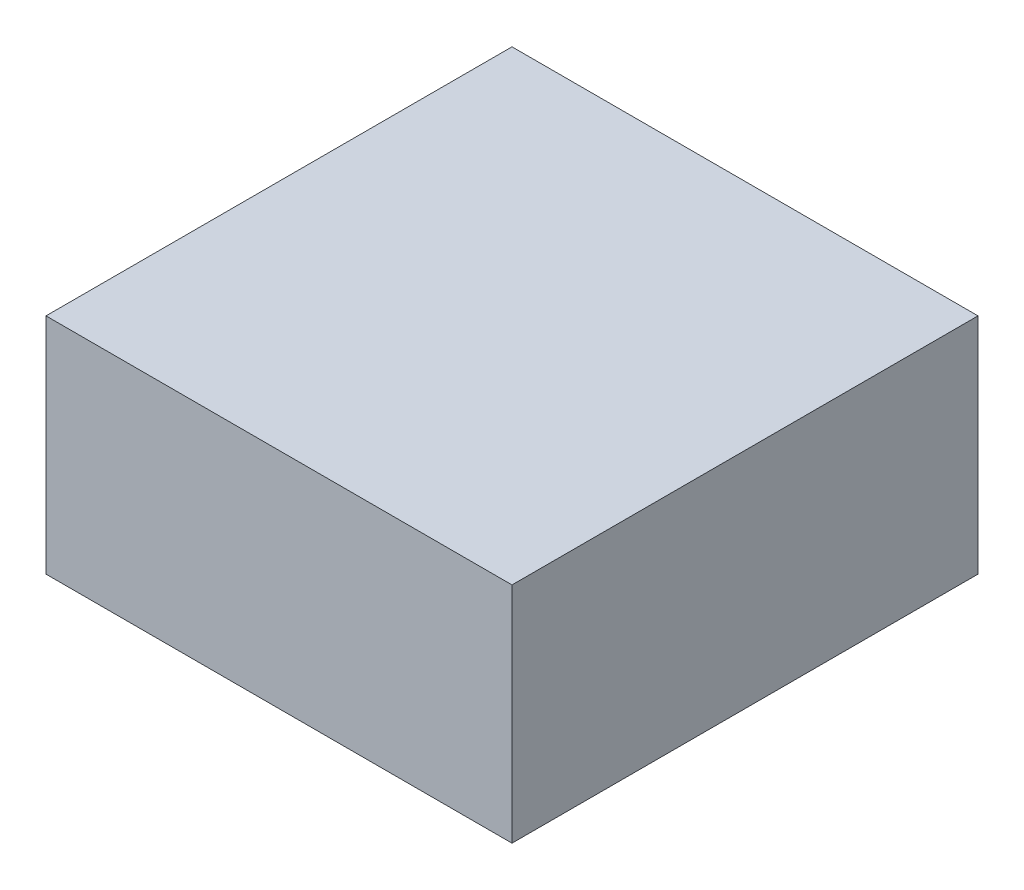
ISO-10303-21;
HEADER;
FILE_DESCRIPTION(('STEP AP214'),'2;1');
FILE_NAME('part.step','',(''),(''),'','','');
FILE_SCHEMA(('AUTOMOTIVE_DESIGN { 1 0 10303 214 1 1 1 1 }'));
ENDSEC;
DATA;
#1=APPLICATION_CONTEXT('core data for automotive mechanical design processes');
#2=APPLICATION_PROTOCOL_DEFINITION('international standard','automotive_design',2000,#1);
#3=PRODUCT_CONTEXT('',#1,'mechanical');
#4=PRODUCT('Part','Part','',(#3));
#5=PRODUCT_RELATED_PRODUCT_CATEGORY('part','',(#4));
#6=PRODUCT_DEFINITION_FORMATION('','',#4);
#7=PRODUCT_DEFINITION_CONTEXT('part definition',#1,'design');
#8=PRODUCT_DEFINITION('design','',#6,#7);
#9=PRODUCT_DEFINITION_SHAPE('','',#8);
#10=(LENGTH_UNIT() NAMED_UNIT(*) SI_UNIT(.MILLI.,.METRE.));
#11=(NAMED_UNIT(*) PLANE_ANGLE_UNIT() SI_UNIT($,.RADIAN.));
#12=(NAMED_UNIT(*) SI_UNIT($,.STERADIAN.) SOLID_ANGLE_UNIT());
#13=UNCERTAINTY_MEASURE_WITH_UNIT(LENGTH_MEASURE(1.E-05),#10,'distance_accuracy_value','');
#14=(GEOMETRIC_REPRESENTATION_CONTEXT(3) GLOBAL_UNCERTAINTY_ASSIGNED_CONTEXT((#13)) GLOBAL_UNIT_ASSIGNED_CONTEXT((#10,
#11,#12)) REPRESENTATION_CONTEXT('',''));
#15=CARTESIAN_POINT('',(0.,0.,0.));
#16=DIRECTION('',(0.,0.,1.));
#17=DIRECTION('',(1.,0.,0.));
#18=AXIS2_PLACEMENT_3D('',#15,#16,#17);
#19=CARTESIAN_POINT('',(-6.35,3.048,-6.35));
#20=DIRECTION('',(1.,0.,0.));
#21=DIRECTION('',(0.,0.,-1.));
#22=AXIS2_PLACEMENT_3D('',#19,#20,#21);
#23=PLANE('',#22);
#24=DIRECTION('',(0.,0.,1.));
#25=VECTOR('',#24,1.);
#26=CARTESIAN_POINT('',(-6.35,-3.048,-6.35));
#27=LINE('',#26,#25);
#28=CARTESIAN_POINT('',(-6.35,-3.048,-6.35));
#29=VERTEX_POINT('',#28);
#30=CARTESIAN_POINT('',(-6.35,-3.048,6.35));
#31=VERTEX_POINT('',#30);
#32=EDGE_CURVE('E96',#29,#31,#27,.T.);
#33=ORIENTED_EDGE('',*,*,#32,.T.);
#34=DIRECTION('',(0.,-1.,0.));
#35=VECTOR('',#34,1.);
#36=CARTESIAN_POINT('',(-6.35,3.048,6.35));
#37=LINE('',#36,#35);
#38=CARTESIAN_POINT('',(-6.35,3.048,6.35));
#39=VERTEX_POINT('',#38);
#40=EDGE_CURVE('E11',#39,#31,#37,.T.);
#41=ORIENTED_EDGE('',*,*,#40,.F.);
#42=DIRECTION('',(0.,0.,1.));
#43=VECTOR('',#42,1.);
#44=CARTESIAN_POINT('',(-6.35,3.048,-6.35));
#45=LINE('',#44,#43);
#46=CARTESIAN_POINT('',(-6.35,3.048,-6.35));
#47=VERTEX_POINT('',#46);
#48=EDGE_CURVE('E84',#47,#39,#45,.T.);
#49=ORIENTED_EDGE('',*,*,#48,.F.);
#50=DIRECTION('',(0.,-1.,0.));
#51=VECTOR('',#50,1.);
#52=CARTESIAN_POINT('',(-6.35,3.048,-6.35));
#53=LINE('',#52,#51);
#54=EDGE_CURVE('E92',#47,#29,#53,.T.);
#55=ORIENTED_EDGE('',*,*,#54,.T.);
#56=EDGE_LOOP('',(#33,#41,#49,#55));
#57=FACE_BOUND('',#56,.T.);
#58=ADVANCED_FACE('F33',(#57),#23,.F.);
#59=CARTESIAN_POINT('',(-6.35,3.048,6.35));
#60=DIRECTION('',(0.,0.,-1.));
#61=DIRECTION('',(-1.,0.,0.));
#62=AXIS2_PLACEMENT_3D('',#59,#60,#61);
#63=PLANE('',#62);
#64=DIRECTION('',(1.,0.,0.));
#65=VECTOR('',#64,1.);
#66=CARTESIAN_POINT('',(-6.35,-3.048,6.35));
#67=LINE('',#66,#65);
#68=CARTESIAN_POINT('',(6.35,-3.048,6.35));
#69=VERTEX_POINT('',#68);
#70=EDGE_CURVE('E88',#31,#69,#67,.T.);
#71=ORIENTED_EDGE('',*,*,#70,.T.);
#72=DIRECTION('',(0.,-1.,0.));
#73=VECTOR('',#72,1.);
#74=CARTESIAN_POINT('',(6.35,3.048,6.35));
#75=LINE('',#74,#73);
#76=CARTESIAN_POINT('',(6.35,3.048,6.35));
#77=VERTEX_POINT('',#76);
#78=EDGE_CURVE('E41',#77,#69,#75,.T.);
#79=ORIENTED_EDGE('',*,*,#78,.F.);
#80=DIRECTION('',(1.,0.,0.));
#81=VECTOR('',#80,1.);
#82=CARTESIAN_POINT('',(-6.35,3.048,6.35));
#83=LINE('',#82,#81);
#84=EDGE_CURVE('E79',#39,#77,#83,.T.);
#85=ORIENTED_EDGE('',*,*,#84,.F.);
#86=ORIENTED_EDGE('',*,*,#40,.T.);
#87=EDGE_LOOP('',(#71,#79,#85,#86));
#88=FACE_BOUND('',#87,.T.);
#89=ADVANCED_FACE('F87',(#88),#63,.F.);
#90=CARTESIAN_POINT('',(6.35,3.048,-6.35));
#91=DIRECTION('',(-1.,0.,0.));
#92=DIRECTION('',(0.,0.,1.));
#93=AXIS2_PLACEMENT_3D('',#90,#91,#92);
#94=PLANE('',#93);
#95=DIRECTION('',(0.,0.,-1.));
#96=VECTOR('',#95,1.);
#97=CARTESIAN_POINT('',(6.35,-3.048,-6.35));
#98=LINE('',#97,#96);
#99=CARTESIAN_POINT('',(6.35,-3.048,-6.35));
#100=VERTEX_POINT('',#99);
#101=EDGE_CURVE('E66',#69,#100,#98,.T.);
#102=ORIENTED_EDGE('',*,*,#101,.T.);
#103=DIRECTION('',(0.,-1.,0.));
#104=VECTOR('',#103,1.);
#105=CARTESIAN_POINT('',(6.35,3.048,-6.35));
#106=LINE('',#105,#104);
#107=CARTESIAN_POINT('',(6.35,3.048,-6.35));
#108=VERTEX_POINT('',#107);
#109=EDGE_CURVE('E89',#108,#100,#106,.T.);
#110=ORIENTED_EDGE('',*,*,#109,.F.);
#111=DIRECTION('',(0.,0.,-1.));
#112=VECTOR('',#111,1.);
#113=CARTESIAN_POINT('',(6.35,3.048,-6.35));
#114=LINE('',#113,#112);
#115=EDGE_CURVE('E82',#77,#108,#114,.T.);
#116=ORIENTED_EDGE('',*,*,#115,.F.);
#117=ORIENTED_EDGE('',*,*,#78,.T.);
#118=EDGE_LOOP('',(#102,#110,#116,#117));
#119=FACE_BOUND('',#118,.T.);
#120=ADVANCED_FACE('F90',(#119),#94,.F.);
#121=CARTESIAN_POINT('',(-6.35,3.048,-6.35));
#122=DIRECTION('',(0.,0.,1.));
#123=DIRECTION('',(1.,0.,0.));
#124=AXIS2_PLACEMENT_3D('',#121,#122,#123);
#125=PLANE('',#124);
#126=DIRECTION('',(-1.,0.,0.));
#127=VECTOR('',#126,1.);
#128=CARTESIAN_POINT('',(-6.35,-3.048,-6.35));
#129=LINE('',#128,#127);
#130=EDGE_CURVE('E72',#100,#29,#129,.T.);
#131=ORIENTED_EDGE('',*,*,#130,.T.);
#132=ORIENTED_EDGE('',*,*,#54,.F.);
#133=DIRECTION('',(-1.,0.,0.));
#134=VECTOR('',#133,1.);
#135=CARTESIAN_POINT('',(-6.35,3.048,-6.35));
#136=LINE('',#135,#134);
#137=EDGE_CURVE('E49',#108,#47,#136,.T.);
#138=ORIENTED_EDGE('',*,*,#137,.F.);
#139=ORIENTED_EDGE('',*,*,#109,.T.);
#140=EDGE_LOOP('',(#131,#132,#138,#139));
#141=FACE_BOUND('',#140,.T.);
#142=ADVANCED_FACE('F103',(#141),#125,.F.);
#143=CARTESIAN_POINT('',(0.,3.048,0.));
#144=DIRECTION('',(0.,1.,0.));
#145=DIRECTION('',(0.,0.,1.));
#146=AXIS2_PLACEMENT_3D('',#143,#144,#145);
#147=PLANE('',#146);
#148=ORIENTED_EDGE('',*,*,#48,.T.);
#149=ORIENTED_EDGE('',*,*,#84,.T.);
#150=ORIENTED_EDGE('',*,*,#115,.T.);
#151=ORIENTED_EDGE('',*,*,#137,.T.);
#152=EDGE_LOOP('',(#148,#149,#150,#151));
#153=FACE_BOUND('',#152,.T.);
#154=ADVANCED_FACE('F80',(#153),#147,.T.);
#155=CARTESIAN_POINT('',(0.,-3.048,0.));
#156=DIRECTION('',(0.,1.,0.));
#157=DIRECTION('',(0.,0.,1.));
#158=AXIS2_PLACEMENT_3D('',#155,#156,#157);
#159=PLANE('',#158);
#160=ORIENTED_EDGE('',*,*,#32,.F.);
#161=ORIENTED_EDGE('',*,*,#130,.F.);
#162=ORIENTED_EDGE('',*,*,#101,.F.);
#163=ORIENTED_EDGE('',*,*,#70,.F.);
#164=EDGE_LOOP('',(#160,#161,#162,#163));
#165=FACE_BOUND('',#164,.T.);
#166=ADVANCED_FACE('F106',(#165),#159,.F.);
#167=CLOSED_SHELL('',(#58,#89,#120,#142,#154,#166));
#168=MANIFOLD_SOLID_BREP('B2',#167);
#169=ADVANCED_BREP_SHAPE_REPRESENTATION('',(#18,#168),#14);
#170=SHAPE_DEFINITION_REPRESENTATION(#9,#169);
ENDSEC;
END-ISO-10303-21;
